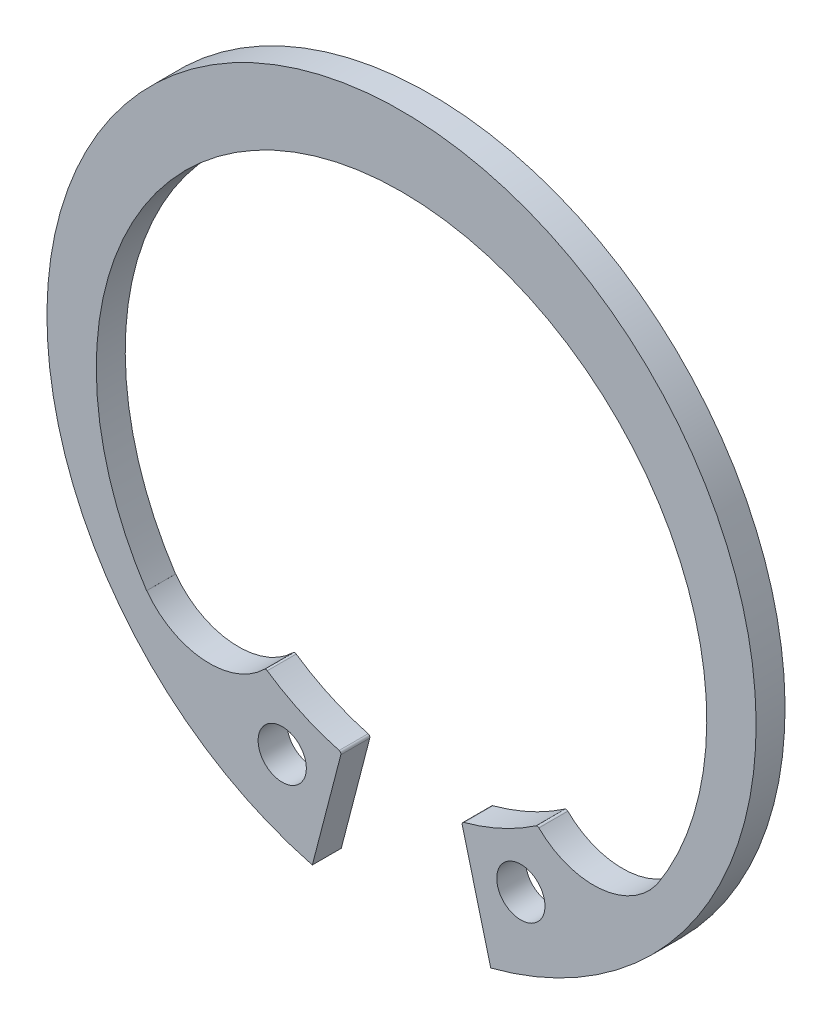
ISO-10303-21;
HEADER;
FILE_DESCRIPTION(('STEP AP214'),'2;1');
FILE_NAME('part.step','',(''),(''),'','','');
FILE_SCHEMA(('AUTOMOTIVE_DESIGN { 1 0 10303 214 1 1 1 1 }'));
ENDSEC;
DATA;
#1=APPLICATION_CONTEXT('core data for automotive mechanical design processes');
#2=APPLICATION_PROTOCOL_DEFINITION('international standard','automotive_design',2000,#1);
#3=PRODUCT_CONTEXT('',#1,'mechanical');
#4=PRODUCT('Part','Part','',(#3));
#5=PRODUCT_RELATED_PRODUCT_CATEGORY('part','',(#4));
#6=PRODUCT_DEFINITION_FORMATION('','',#4);
#7=PRODUCT_DEFINITION_CONTEXT('part definition',#1,'design');
#8=PRODUCT_DEFINITION('design','',#6,#7);
#9=PRODUCT_DEFINITION_SHAPE('','',#8);
#10=(LENGTH_UNIT() NAMED_UNIT(*) SI_UNIT(.MILLI.,.METRE.));
#11=(NAMED_UNIT(*) PLANE_ANGLE_UNIT() SI_UNIT($,.RADIAN.));
#12=(NAMED_UNIT(*) SI_UNIT($,.STERADIAN.) SOLID_ANGLE_UNIT());
#13=UNCERTAINTY_MEASURE_WITH_UNIT(LENGTH_MEASURE(1.E-05),#10,'distance_accuracy_value','');
#14=(GEOMETRIC_REPRESENTATION_CONTEXT(3) GLOBAL_UNCERTAINTY_ASSIGNED_CONTEXT((#13)) GLOBAL_UNIT_ASSIGNED_CONTEXT((#10,
#11,#12)) REPRESENTATION_CONTEXT('',''));
#15=CARTESIAN_POINT('',(0.,0.,0.));
#16=DIRECTION('',(0.,0.,1.));
#17=DIRECTION('',(1.,0.,0.));
#18=AXIS2_PLACEMENT_3D('',#15,#16,#17);
#19=CARTESIAN_POINT('',(0.,0.,-1.2));
#20=DIRECTION('',(0.,0.,1.));
#21=DIRECTION('',(1.,0.,0.));
#22=AXIS2_PLACEMENT_3D('',#19,#20,#21);
#23=CYLINDRICAL_SURFACE('',#22,14.7);
#24=CARTESIAN_POINT('',(0.,0.,-1.2));
#25=DIRECTION('',(0.,0.,1.));
#26=DIRECTION('',(1.,0.,0.));
#27=AXIS2_PLACEMENT_3D('',#24,#25,#26);
#28=CIRCLE('',#27,14.7);
#29=CARTESIAN_POINT('',(3.69832542704428,-14.2271708022248,-1.2));
#30=VERTEX_POINT('',#29);
#31=CARTESIAN_POINT('',(-3.69832542704428,-14.2271708022248,-1.2));
#32=VERTEX_POINT('',#31);
#33=EDGE_CURVE('E146',#30,#32,#28,.T.);
#34=ORIENTED_EDGE('',*,*,#33,.T.);
#35=DIRECTION('',(0.,0.,1.));
#36=VECTOR('',#35,1.);
#37=CARTESIAN_POINT('',(-3.69832542704428,-14.2271708022248,-1.2));
#38=LINE('',#37,#36);
#39=CARTESIAN_POINT('',(-3.69832542704428,-14.2271708022248,0.));
#40=VERTEX_POINT('',#39);
#41=EDGE_CURVE('E36',#32,#40,#38,.T.);
#42=ORIENTED_EDGE('',*,*,#41,.T.);
#43=CARTESIAN_POINT('',(0.,0.,0.));
#44=DIRECTION('',(0.,0.,1.));
#45=DIRECTION('',(1.,0.,0.));
#46=AXIS2_PLACEMENT_3D('',#43,#44,#45);
#47=CIRCLE('',#46,14.7);
#48=CARTESIAN_POINT('',(3.69832542704428,-14.2271708022248,0.));
#49=VERTEX_POINT('',#48);
#50=EDGE_CURVE('E57',#49,#40,#47,.T.);
#51=ORIENTED_EDGE('',*,*,#50,.F.);
#52=DIRECTION('',(0.,0.,1.));
#53=VECTOR('',#52,1.);
#54=CARTESIAN_POINT('',(3.69832542704428,-14.2271708022248,-1.2));
#55=LINE('',#54,#53);
#56=EDGE_CURVE('E11',#30,#49,#55,.T.);
#57=ORIENTED_EDGE('',*,*,#56,.F.);
#58=EDGE_LOOP('',(#34,#42,#51,#57));
#59=FACE_BOUND('',#58,.T.);
#60=ADVANCED_FACE('F33',(#59),#23,.T.);
#61=CARTESIAN_POINT('',(3.69832542704428,-14.2271708022248,-1.2));
#62=DIRECTION('',(-0.967834748450666,-0.251586763744509,0.));
#63=DIRECTION('',(0.251586763744509,-0.967834748450666,0.));
#64=AXIS2_PLACEMENT_3D('',#61,#62,#63);
#65=PLANE('',#64);
#66=DIRECTION('',(0.251586763744509,-0.967834748450666,0.));
#67=VECTOR('',#66,1.);
#68=CARTESIAN_POINT('',(3.69832542704428,-14.2271708022248,0.));
#69=LINE('',#68,#67);
#70=CARTESIAN_POINT('',(2.51574184091823,-9.6778635550339,0.));
#71=VERTEX_POINT('',#70);
#72=EDGE_CURVE('E249',#71,#49,#69,.T.);
#73=ORIENTED_EDGE('',*,*,#72,.F.);
#74=DIRECTION('',(0.,0.,1.));
#75=VECTOR('',#74,1.);
#76=CARTESIAN_POINT('',(2.51574184091823,-9.6778635550339,-1.2));
#77=LINE('',#76,#75);
#78=CARTESIAN_POINT('',(2.51574184091823,-9.6778635550339,-1.2));
#79=VERTEX_POINT('',#78);
#80=EDGE_CURVE('E222',#79,#71,#77,.T.);
#81=ORIENTED_EDGE('',*,*,#80,.F.);
#82=DIRECTION('',(0.251586763744509,-0.967834748450666,0.));
#83=VECTOR('',#82,1.);
#84=CARTESIAN_POINT('',(3.69832542704428,-14.2271708022248,-1.2));
#85=LINE('',#84,#83);
#86=EDGE_CURVE('E252',#79,#30,#85,.T.);
#87=ORIENTED_EDGE('',*,*,#86,.T.);
#88=ORIENTED_EDGE('',*,*,#56,.T.);
#89=EDGE_LOOP('',(#73,#81,#87,#88));
#90=FACE_BOUND('',#89,.T.);
#91=ADVANCED_FACE('F265',(#90),#65,.T.);
#92=CARTESIAN_POINT('',(0.,-0.854718275483989,-1.2));
#93=DIRECTION('',(0.,0.,1.));
#94=DIRECTION('',(1.,0.,0.));
#95=AXIS2_PLACEMENT_3D('',#92,#93,#94);
#96=CYLINDRICAL_SURFACE('',#95,12.654718275484);
#97=DIRECTION('',(0.,0.,1.));
#98=VECTOR('',#97,1.);
#99=CARTESIAN_POINT('',(-10.5686210689552,-7.81504465667515,-1.2));
#100=LINE('',#99,#98);
#101=CARTESIAN_POINT('',(-10.5686210689552,-7.81504465667515,-1.2));
#102=VERTEX_POINT('',#101);
#103=CARTESIAN_POINT('',(-10.5686210689552,-7.81504465667515,0.));
#104=VERTEX_POINT('',#103);
#105=EDGE_CURVE('E187',#102,#104,#100,.T.);
#106=ORIENTED_EDGE('',*,*,#105,.F.);
#107=CARTESIAN_POINT('',(0.,-0.854718275483989,-1.2));
#108=DIRECTION('',(0.,0.,-1.));
#109=DIRECTION('',(1.,0.,0.));
#110=AXIS2_PLACEMENT_3D('',#107,#108,#109);
#111=CIRCLE('',#110,12.654718275484);
#112=CARTESIAN_POINT('',(10.5686210689552,-7.81504465667515,-1.2));
#113=VERTEX_POINT('',#112);
#114=EDGE_CURVE('E65',#102,#113,#111,.T.);
#115=ORIENTED_EDGE('',*,*,#114,.T.);
#116=DIRECTION('',(0.,0.,1.));
#117=VECTOR('',#116,1.);
#118=CARTESIAN_POINT('',(10.5686210689552,-7.81504465667515,-1.2));
#119=LINE('',#118,#117);
#120=CARTESIAN_POINT('',(10.5686210689552,-7.81504465667515,0.));
#121=VERTEX_POINT('',#120);
#122=EDGE_CURVE('E225',#121,#113,#119,.F.);
#123=ORIENTED_EDGE('',*,*,#122,.F.);
#124=CARTESIAN_POINT('',(0.,-0.854718275483989,0.));
#125=DIRECTION('',(0.,0.,-1.));
#126=DIRECTION('',(1.,0.,0.));
#127=AXIS2_PLACEMENT_3D('',#124,#125,#126);
#128=CIRCLE('',#127,12.654718275484);
#129=EDGE_CURVE('E258',#104,#121,#128,.T.);
#130=ORIENTED_EDGE('',*,*,#129,.F.);
#131=EDGE_LOOP('',(#106,#115,#123,#130));
#132=FACE_BOUND('',#131,.T.);
#133=ADVANCED_FACE('F287',(#132),#96,.F.);
#134=CARTESIAN_POINT('',(-3.69832542704428,-14.2271708022248,-1.2));
#135=DIRECTION('',(0.967834748450666,-0.251586763744509,0.));
#136=DIRECTION('',(0.251586763744509,0.967834748450667,0.));
#137=AXIS2_PLACEMENT_3D('',#134,#135,#136);
#138=PLANE('',#137);
#139=DIRECTION('',(0.251586763744509,0.967834748450666,0.));
#140=VECTOR('',#139,1.);
#141=CARTESIAN_POINT('',(-3.69832542704428,-14.2271708022248,0.));
#142=LINE('',#141,#140);
#143=CARTESIAN_POINT('',(-2.51574184091823,-9.6778635550339,0.));
#144=VERTEX_POINT('',#143);
#145=EDGE_CURVE('E256',#40,#144,#142,.T.);
#146=ORIENTED_EDGE('',*,*,#145,.F.);
#147=ORIENTED_EDGE('',*,*,#41,.F.);
#148=DIRECTION('',(0.251586763744509,0.967834748450666,0.));
#149=VECTOR('',#148,1.);
#150=CARTESIAN_POINT('',(-3.69832542704428,-14.2271708022248,-1.2));
#151=LINE('',#150,#149);
#152=CARTESIAN_POINT('',(-2.51574184091823,-9.6778635550339,-1.2));
#153=VERTEX_POINT('',#152);
#154=EDGE_CURVE('E138',#32,#153,#151,.T.);
#155=ORIENTED_EDGE('',*,*,#154,.T.);
#156=DIRECTION('',(0.,0.,1.));
#157=VECTOR('',#156,1.);
#158=CARTESIAN_POINT('',(-2.51574184091823,-9.6778635550339,-1.2));
#159=LINE('',#158,#157);
#160=EDGE_CURVE('E142',#153,#144,#159,.T.);
#161=ORIENTED_EDGE('',*,*,#160,.T.);
#162=EDGE_LOOP('',(#146,#147,#155,#161));
#163=FACE_BOUND('',#162,.T.);
#164=ADVANCED_FACE('F141',(#163),#138,.T.);
#165=CARTESIAN_POINT('',(0.,0.,-1.2));
#166=DIRECTION('',(0.,0.,1.));
#167=DIRECTION('',(1.,0.,0.));
#168=AXIS2_PLACEMENT_3D('',#165,#166,#167);
#169=PLANE('',#168);
#170=ORIENTED_EDGE('',*,*,#114,.F.);
#171=DIRECTION('',(-0.80405047480539,-0.594561043094169,0.));
#172=VECTOR('',#171,1.);
#173=CARTESIAN_POINT('',(-11.8195419796392,-8.74004733348428,-1.2));
#174=LINE('',#173,#172);
#175=CARTESIAN_POINT('',(-10.5634463798531,-7.81121819472204,-1.2));
#176=VERTEX_POINT('',#175);
#177=EDGE_CURVE('E156',#176,#102,#174,.T.);
#178=ORIENTED_EDGE('',*,*,#177,.F.);
#179=CARTESIAN_POINT('',(-7.96009970057337,-5.88615432663227,-1.2));
#180=DIRECTION('',(0.,0.,-1.));
#181=DIRECTION('',(1.,0.,0.));
#182=AXIS2_PLACEMENT_3D('',#179,#180,#181);
#183=CIRCLE('',#182,3.23779011499222);
#184=CARTESIAN_POINT('',(-5.69310927120739,-8.19787213421702,-1.2));
#185=VERTEX_POINT('',#184);
#186=EDGE_CURVE('E173',#185,#176,#183,.T.);
#187=ORIENTED_EDGE('',*,*,#186,.F.);
#188=CARTESIAN_POINT('',(-5.62309267504605,-8.26927014722844,-1.2));
#189=DIRECTION('',(0.,0.,1.));
#190=DIRECTION('',(1.,0.,0.));
#191=AXIS2_PLACEMENT_3D('',#188,#189,#190);
#192=CIRCLE('',#191,0.0999999999999989);
#193=CARTESIAN_POINT('',(-5.56686174829559,-8.18657744575616,-1.2));
#194=VERTEX_POINT('',#193);
#195=EDGE_CURVE('E165',#194,#185,#192,.T.);
#196=ORIENTED_EDGE('',*,*,#195,.F.);
#197=CARTESIAN_POINT('',(0.,0.,-1.2));
#198=DIRECTION('',(0.,0.,-1.));
#199=DIRECTION('',(1.,0.,0.));
#200=AXIS2_PLACEMENT_3D('',#197,#198,#199);
#201=CIRCLE('',#200,9.9);
#202=CARTESIAN_POINT('',(-2.58640006260566,-9.55617782987285,-1.2));
#203=VERTEX_POINT('',#202);
#204=EDGE_CURVE('E161',#203,#194,#201,.T.);
#205=ORIENTED_EDGE('',*,*,#204,.F.);
#206=CARTESIAN_POINT('',(-2.61252531576329,-9.65270487865945,-1.2));
#207=DIRECTION('',(0.,0.,1.));
#208=DIRECTION('',(-1.,0.,0.));
#209=AXIS2_PLACEMENT_3D('',#206,#207,#208);
#210=CIRCLE('',#209,0.100000000000001);
#211=EDGE_CURVE('E152',#153,#203,#210,.T.);
#212=ORIENTED_EDGE('',*,*,#211,.F.);
#213=ORIENTED_EDGE('',*,*,#154,.F.);
#214=ORIENTED_EDGE('',*,*,#33,.F.);
#215=ORIENTED_EDGE('',*,*,#86,.F.);
#216=CARTESIAN_POINT('',(2.61252531576329,-9.65270487865945,-1.2));
#217=DIRECTION('',(0.,0.,1.));
#218=DIRECTION('',(1.,0.,0.));
#219=AXIS2_PLACEMENT_3D('',#216,#217,#218);
#220=CIRCLE('',#219,0.0999999999999994);
#221=CARTESIAN_POINT('',(2.58640006260566,-9.55617782987285,-1.2));
#222=VERTEX_POINT('',#221);
#223=EDGE_CURVE('E207',#222,#79,#220,.T.);
#224=ORIENTED_EDGE('',*,*,#223,.F.);
#225=CARTESIAN_POINT('',(0.,0.,-1.2));
#226=DIRECTION('',(0.,0.,-1.));
#227=DIRECTION('',(1.,0.,0.));
#228=AXIS2_PLACEMENT_3D('',#225,#226,#227);
#229=CIRCLE('',#228,9.9);
#230=CARTESIAN_POINT('',(5.56686174829559,-8.18657744575616,-1.2));
#231=VERTEX_POINT('',#230);
#232=EDGE_CURVE('E205',#231,#222,#229,.T.);
#233=ORIENTED_EDGE('',*,*,#232,.F.);
#234=CARTESIAN_POINT('',(5.62309267504605,-8.26927014722844,-1.2));
#235=DIRECTION('',(0.,0.,1.));
#236=DIRECTION('',(-1.,0.,0.));
#237=AXIS2_PLACEMENT_3D('',#234,#235,#236);
#238=CIRCLE('',#237,0.0999999999999989);
#239=CARTESIAN_POINT('',(5.69310927120739,-8.19787213421702,-1.2));
#240=VERTEX_POINT('',#239);
#241=EDGE_CURVE('E202',#240,#231,#238,.T.);
#242=ORIENTED_EDGE('',*,*,#241,.F.);
#243=CARTESIAN_POINT('',(7.96009970057337,-5.88615432663227,-1.2));
#244=DIRECTION('',(0.,0.,-1.));
#245=DIRECTION('',(1.,0.,0.));
#246=AXIS2_PLACEMENT_3D('',#243,#244,#245);
#247=CIRCLE('',#246,3.23779011499222);
#248=CARTESIAN_POINT('',(10.5634463798531,-7.81121819472204,-1.2));
#249=VERTEX_POINT('',#248);
#250=EDGE_CURVE('E198',#249,#240,#247,.T.);
#251=ORIENTED_EDGE('',*,*,#250,.F.);
#252=DIRECTION('',(-0.80405047480539,0.594561043094169,0.));
#253=VECTOR('',#252,1.);
#254=CARTESIAN_POINT('',(10.5634463798531,-7.81121819472204,-1.2));
#255=LINE('',#254,#253);
#256=EDGE_CURVE('E196',#113,#249,#255,.T.);
#257=ORIENTED_EDGE('',*,*,#256,.F.);
#258=EDGE_LOOP('',(#170,#178,#187,#196,#205,#212,#213,#214,#215,#224,#233,#242,#251,#257));
#259=FACE_BOUND('',#258,.T.);
#260=CARTESIAN_POINT('',(4.94595449661961,-10.8784205708994,-1.2));
#261=DIRECTION('',(0.,0.,1.));
#262=DIRECTION('',(1.,0.,0.));
#263=AXIS2_PLACEMENT_3D('',#260,#261,#262);
#264=CIRCLE('',#263,1.);
#265=CARTESIAN_POINT('',(5.94595449661961,-10.8784205708994,-1.2));
#266=VERTEX_POINT('',#265);
#267=EDGE_CURVE('E244',#266,#266,#264,.T.);
#268=ORIENTED_EDGE('',*,*,#267,.T.);
#269=EDGE_LOOP('',(#268));
#270=FACE_BOUND('',#269,.T.);
#271=CARTESIAN_POINT('',(-4.94595449661961,-10.8784205708994,-1.2));
#272=DIRECTION('',(0.,0.,1.));
#273=DIRECTION('',(1.,0.,0.));
#274=AXIS2_PLACEMENT_3D('',#271,#272,#273);
#275=CIRCLE('',#274,1.);
#276=CARTESIAN_POINT('',(-3.94595449661961,-10.8784205708994,-1.2));
#277=VERTEX_POINT('',#276);
#278=EDGE_CURVE('E238',#277,#277,#275,.T.);
#279=ORIENTED_EDGE('',*,*,#278,.T.);
#280=EDGE_LOOP('',(#279));
#281=FACE_BOUND('',#280,.T.);
#282=ADVANCED_FACE('F158',(#259,#270,#281),#169,.F.);
#283=CARTESIAN_POINT('',(0.,0.,0.));
#284=DIRECTION('',(0.,0.,1.));
#285=DIRECTION('',(1.,0.,0.));
#286=AXIS2_PLACEMENT_3D('',#283,#284,#285);
#287=PLANE('',#286);
#288=DIRECTION('',(-0.80405047480539,-0.594561043094169,0.));
#289=VECTOR('',#288,1.);
#290=CARTESIAN_POINT('',(-11.8195419796392,-8.74004733348428,0.));
#291=LINE('',#290,#289);
#292=CARTESIAN_POINT('',(-10.5634463798531,-7.81121819472204,0.));
#293=VERTEX_POINT('',#292);
#294=EDGE_CURVE('E163',#293,#104,#291,.T.);
#295=ORIENTED_EDGE('',*,*,#294,.T.);
#296=ORIENTED_EDGE('',*,*,#129,.T.);
#297=DIRECTION('',(-0.80405047480539,0.594561043094169,0.));
#298=VECTOR('',#297,1.);
#299=CARTESIAN_POINT('',(10.5634463798531,-7.81121819472204,0.));
#300=LINE('',#299,#298);
#301=CARTESIAN_POINT('',(10.5634463798531,-7.81121819472204,0.));
#302=VERTEX_POINT('',#301);
#303=EDGE_CURVE('E195',#121,#302,#300,.T.);
#304=ORIENTED_EDGE('',*,*,#303,.T.);
#305=CARTESIAN_POINT('',(7.96009970057337,-5.88615432663227,0.));
#306=DIRECTION('',(0.,0.,-1.));
#307=DIRECTION('',(1.,0.,0.));
#308=AXIS2_PLACEMENT_3D('',#305,#306,#307);
#309=CIRCLE('',#308,3.23779011499222);
#310=CARTESIAN_POINT('',(5.69310927120739,-8.19787213421702,0.));
#311=VERTEX_POINT('',#310);
#312=EDGE_CURVE('E212',#302,#311,#309,.T.);
#313=ORIENTED_EDGE('',*,*,#312,.T.);
#314=CARTESIAN_POINT('',(5.62309267504605,-8.26927014722844,0.));
#315=DIRECTION('',(0.,0.,1.));
#316=DIRECTION('',(-1.,0.,0.));
#317=AXIS2_PLACEMENT_3D('',#314,#315,#316);
#318=CIRCLE('',#317,0.0999999999999989);
#319=CARTESIAN_POINT('',(5.56686174829559,-8.18657744575616,0.));
#320=VERTEX_POINT('',#319);
#321=EDGE_CURVE('E215',#311,#320,#318,.T.);
#322=ORIENTED_EDGE('',*,*,#321,.T.);
#323=CARTESIAN_POINT('',(0.,0.,0.));
#324=DIRECTION('',(0.,0.,-1.));
#325=DIRECTION('',(1.,0.,0.));
#326=AXIS2_PLACEMENT_3D('',#323,#324,#325);
#327=CIRCLE('',#326,9.9);
#328=CARTESIAN_POINT('',(2.58640006260566,-9.55617782987285,0.));
#329=VERTEX_POINT('',#328);
#330=EDGE_CURVE('E218',#320,#329,#327,.T.);
#331=ORIENTED_EDGE('',*,*,#330,.T.);
#332=CARTESIAN_POINT('',(2.61252531576329,-9.65270487865945,0.));
#333=DIRECTION('',(0.,0.,1.));
#334=DIRECTION('',(1.,0.,0.));
#335=AXIS2_PLACEMENT_3D('',#332,#333,#334);
#336=CIRCLE('',#335,0.0999999999999994);
#337=EDGE_CURVE('E199',#329,#71,#336,.T.);
#338=ORIENTED_EDGE('',*,*,#337,.T.);
#339=ORIENTED_EDGE('',*,*,#72,.T.);
#340=ORIENTED_EDGE('',*,*,#50,.T.);
#341=ORIENTED_EDGE('',*,*,#145,.T.);
#342=CARTESIAN_POINT('',(-2.61252531576329,-9.65270487865945,0.));
#343=DIRECTION('',(0.,0.,1.));
#344=DIRECTION('',(-1.,0.,0.));
#345=AXIS2_PLACEMENT_3D('',#342,#343,#344);
#346=CIRCLE('',#345,0.100000000000001);
#347=CARTESIAN_POINT('',(-2.58640006260566,-9.55617782987285,0.));
#348=VERTEX_POINT('',#347);
#349=EDGE_CURVE('E154',#144,#348,#346,.T.);
#350=ORIENTED_EDGE('',*,*,#349,.T.);
#351=CARTESIAN_POINT('',(0.,0.,0.));
#352=DIRECTION('',(0.,0.,-1.));
#353=DIRECTION('',(1.,0.,0.));
#354=AXIS2_PLACEMENT_3D('',#351,#352,#353);
#355=CIRCLE('',#354,9.9);
#356=CARTESIAN_POINT('',(-5.56686174829559,-8.18657744575616,0.));
#357=VERTEX_POINT('',#356);
#358=EDGE_CURVE('E178',#348,#357,#355,.T.);
#359=ORIENTED_EDGE('',*,*,#358,.T.);
#360=CARTESIAN_POINT('',(-5.62309267504605,-8.26927014722844,0.));
#361=DIRECTION('',(0.,0.,1.));
#362=DIRECTION('',(1.,0.,0.));
#363=AXIS2_PLACEMENT_3D('',#360,#361,#362);
#364=CIRCLE('',#363,0.0999999999999989);
#365=CARTESIAN_POINT('',(-5.69310927120739,-8.19787213421702,0.));
#366=VERTEX_POINT('',#365);
#367=EDGE_CURVE('E180',#357,#366,#364,.T.);
#368=ORIENTED_EDGE('',*,*,#367,.T.);
#369=CARTESIAN_POINT('',(-7.96009970057337,-5.88615432663227,0.));
#370=DIRECTION('',(0.,0.,-1.));
#371=DIRECTION('',(1.,0.,0.));
#372=AXIS2_PLACEMENT_3D('',#369,#370,#371);
#373=CIRCLE('',#372,3.23779011499222);
#374=EDGE_CURVE('E168',#366,#293,#373,.T.);
#375=ORIENTED_EDGE('',*,*,#374,.T.);
#376=EDGE_LOOP('',(#295,#296,#304,#313,#322,#331,#338,#339,#340,#341,#350,#359,#368,#375));
#377=FACE_BOUND('',#376,.T.);
#378=CARTESIAN_POINT('',(4.94595449661961,-10.8784205708994,0.));
#379=DIRECTION('',(0.,0.,1.));
#380=DIRECTION('',(1.,0.,0.));
#381=AXIS2_PLACEMENT_3D('',#378,#379,#380);
#382=CIRCLE('',#381,1.);
#383=CARTESIAN_POINT('',(5.94595449661961,-10.8784205708994,0.));
#384=VERTEX_POINT('',#383);
#385=EDGE_CURVE('E241',#384,#384,#382,.T.);
#386=ORIENTED_EDGE('',*,*,#385,.F.);
#387=EDGE_LOOP('',(#386));
#388=FACE_BOUND('',#387,.T.);
#389=CARTESIAN_POINT('',(-4.94595449661961,-10.8784205708994,0.));
#390=DIRECTION('',(0.,0.,1.));
#391=DIRECTION('',(1.,0.,0.));
#392=AXIS2_PLACEMENT_3D('',#389,#390,#391);
#393=CIRCLE('',#392,1.);
#394=CARTESIAN_POINT('',(-3.94595449661961,-10.8784205708994,0.));
#395=VERTEX_POINT('',#394);
#396=EDGE_CURVE('E237',#395,#395,#393,.T.);
#397=ORIENTED_EDGE('',*,*,#396,.F.);
#398=EDGE_LOOP('',(#397));
#399=FACE_BOUND('',#398,.T.);
#400=ADVANCED_FACE('F260',(#377,#388,#399),#287,.T.);
#401=CARTESIAN_POINT('',(4.94595449661961,-10.8784205708994,-1.2));
#402=DIRECTION('',(0.,0.,1.));
#403=DIRECTION('',(1.,0.,0.));
#404=AXIS2_PLACEMENT_3D('',#401,#402,#403);
#405=CYLINDRICAL_SURFACE('',#404,1.);
#406=ORIENTED_EDGE('',*,*,#267,.F.);
#407=EDGE_LOOP('',(#406));
#408=FACE_BOUND('',#407,.T.);
#409=ORIENTED_EDGE('',*,*,#385,.T.);
#410=EDGE_LOOP('',(#409));
#411=FACE_BOUND('',#410,.T.);
#412=ADVANCED_FACE('F310',(#408,#411),#405,.F.);
#413=CARTESIAN_POINT('',(-4.94595449661961,-10.8784205708994,-1.2));
#414=DIRECTION('',(0.,0.,1.));
#415=DIRECTION('',(1.,0.,0.));
#416=AXIS2_PLACEMENT_3D('',#413,#414,#415);
#417=CYLINDRICAL_SURFACE('',#416,1.);
#418=ORIENTED_EDGE('',*,*,#278,.F.);
#419=EDGE_LOOP('',(#418));
#420=FACE_BOUND('',#419,.T.);
#421=ORIENTED_EDGE('',*,*,#396,.T.);
#422=EDGE_LOOP('',(#421));
#423=FACE_BOUND('',#422,.T.);
#424=ADVANCED_FACE('F303',(#420,#423),#417,.F.);
#425=CARTESIAN_POINT('',(0.,0.,-1.2));
#426=DIRECTION('',(0.,0.,1.));
#427=DIRECTION('',(1.,0.,0.));
#428=AXIS2_PLACEMENT_3D('',#425,#426,#427);
#429=CYLINDRICAL_SURFACE('',#428,9.9);
#430=ORIENTED_EDGE('',*,*,#330,.F.);
#431=DIRECTION('',(0.,0.,1.));
#432=VECTOR('',#431,1.);
#433=CARTESIAN_POINT('',(5.56686174829559,-8.18657744575616,-1.2));
#434=LINE('',#433,#432);
#435=EDGE_CURVE('E229',#231,#320,#434,.T.);
#436=ORIENTED_EDGE('',*,*,#435,.F.);
#437=ORIENTED_EDGE('',*,*,#232,.T.);
#438=DIRECTION('',(0.,0.,1.));
#439=VECTOR('',#438,1.);
#440=CARTESIAN_POINT('',(2.58640006260566,-9.55617782987285,-1.2));
#441=LINE('',#440,#439);
#442=EDGE_CURVE('E226',#222,#329,#441,.T.);
#443=ORIENTED_EDGE('',*,*,#442,.T.);
#444=EDGE_LOOP('',(#430,#436,#437,#443));
#445=FACE_BOUND('',#444,.T.);
#446=ADVANCED_FACE('F301',(#445),#429,.F.);
#447=CARTESIAN_POINT('',(2.61252531576329,-9.65270487865945,-1.2));
#448=DIRECTION('',(0.,0.,1.));
#449=DIRECTION('',(1.,0.,0.));
#450=AXIS2_PLACEMENT_3D('',#447,#448,#449);
#451=CYLINDRICAL_SURFACE('',#450,0.0999999999999994);
#452=ORIENTED_EDGE('',*,*,#337,.F.);
#453=ORIENTED_EDGE('',*,*,#442,.F.);
#454=ORIENTED_EDGE('',*,*,#223,.T.);
#455=ORIENTED_EDGE('',*,*,#80,.T.);
#456=EDGE_LOOP('',(#452,#453,#454,#455));
#457=FACE_BOUND('',#456,.T.);
#458=ADVANCED_FACE('F267',(#457),#451,.T.);
#459=CARTESIAN_POINT('',(5.62309267504605,-8.26927014722844,-1.2));
#460=DIRECTION('',(0.,0.,1.));
#461=DIRECTION('',(1.,0.,0.));
#462=AXIS2_PLACEMENT_3D('',#459,#460,#461);
#463=CYLINDRICAL_SURFACE('',#462,0.0999999999999989);
#464=ORIENTED_EDGE('',*,*,#321,.F.);
#465=DIRECTION('',(0.,0.,1.));
#466=VECTOR('',#465,1.);
#467=CARTESIAN_POINT('',(5.69310927120739,-8.19787213421702,-1.2));
#468=LINE('',#467,#466);
#469=EDGE_CURVE('E232',#240,#311,#468,.T.);
#470=ORIENTED_EDGE('',*,*,#469,.F.);
#471=ORIENTED_EDGE('',*,*,#241,.T.);
#472=ORIENTED_EDGE('',*,*,#435,.T.);
#473=EDGE_LOOP('',(#464,#470,#471,#472));
#474=FACE_BOUND('',#473,.T.);
#475=ADVANCED_FACE('F299',(#474),#463,.T.);
#476=CARTESIAN_POINT('',(7.96009970057337,-5.88615432663227,-1.2));
#477=DIRECTION('',(0.,0.,1.));
#478=DIRECTION('',(1.,0.,0.));
#479=AXIS2_PLACEMENT_3D('',#476,#477,#478);
#480=CYLINDRICAL_SURFACE('',#479,3.23779011499222);
#481=ORIENTED_EDGE('',*,*,#312,.F.);
#482=DIRECTION('',(0.,0.,1.));
#483=VECTOR('',#482,1.);
#484=CARTESIAN_POINT('',(10.5634463798531,-7.81121819472204,-1.2));
#485=LINE('',#484,#483);
#486=EDGE_CURVE('E210',#249,#302,#485,.T.);
#487=ORIENTED_EDGE('',*,*,#486,.F.);
#488=ORIENTED_EDGE('',*,*,#250,.T.);
#489=ORIENTED_EDGE('',*,*,#469,.T.);
#490=EDGE_LOOP('',(#481,#487,#488,#489));
#491=FACE_BOUND('',#490,.T.);
#492=ADVANCED_FACE('F296',(#491),#480,.F.);
#493=CARTESIAN_POINT('',(10.5634463798531,-7.81121819472204,-1.2));
#494=DIRECTION('',(0.59456104309417,0.80405047480539,0.));
#495=DIRECTION('',(-0.80405047480539,0.59456104309417,0.));
#496=AXIS2_PLACEMENT_3D('',#493,#494,#495);
#497=PLANE('',#496);
#498=ORIENTED_EDGE('',*,*,#303,.F.);
#499=ORIENTED_EDGE('',*,*,#122,.T.);
#500=ORIENTED_EDGE('',*,*,#256,.T.);
#501=ORIENTED_EDGE('',*,*,#486,.T.);
#502=EDGE_LOOP('',(#498,#499,#500,#501));
#503=FACE_BOUND('',#502,.T.);
#504=ADVANCED_FACE('F293',(#503),#497,.T.);
#505=CARTESIAN_POINT('',(0.,0.,-1.2));
#506=DIRECTION('',(0.,0.,1.));
#507=DIRECTION('',(1.,0.,0.));
#508=AXIS2_PLACEMENT_3D('',#505,#506,#507);
#509=CYLINDRICAL_SURFACE('',#508,9.9);
#510=ORIENTED_EDGE('',*,*,#358,.F.);
#511=DIRECTION('',(0.,0.,1.));
#512=VECTOR('',#511,1.);
#513=CARTESIAN_POINT('',(-2.58640006260566,-9.55617782987285,-1.2));
#514=LINE('',#513,#512);
#515=EDGE_CURVE('E155',#203,#348,#514,.T.);
#516=ORIENTED_EDGE('',*,*,#515,.F.);
#517=ORIENTED_EDGE('',*,*,#204,.T.);
#518=DIRECTION('',(0.,0.,1.));
#519=VECTOR('',#518,1.);
#520=CARTESIAN_POINT('',(-5.56686174829559,-8.18657744575616,-1.2));
#521=LINE('',#520,#519);
#522=EDGE_CURVE('E190',#194,#357,#521,.T.);
#523=ORIENTED_EDGE('',*,*,#522,.T.);
#524=EDGE_LOOP('',(#510,#516,#517,#523));
#525=FACE_BOUND('',#524,.T.);
#526=ADVANCED_FACE('F275',(#525),#509,.F.);
#527=CARTESIAN_POINT('',(-11.8195419796392,-8.74004733348428,-1.2));
#528=DIRECTION('',(-0.59456104309417,0.80405047480539,0.));
#529=DIRECTION('',(-0.80405047480539,-0.59456104309417,0.));
#530=AXIS2_PLACEMENT_3D('',#527,#528,#529);
#531=PLANE('',#530);
#532=ORIENTED_EDGE('',*,*,#177,.T.);
#533=ORIENTED_EDGE('',*,*,#105,.T.);
#534=ORIENTED_EDGE('',*,*,#294,.F.);
#535=DIRECTION('',(0.,0.,1.));
#536=VECTOR('',#535,1.);
#537=CARTESIAN_POINT('',(-10.5634463798531,-7.81121819472204,-1.2));
#538=LINE('',#537,#536);
#539=EDGE_CURVE('E185',#176,#293,#538,.T.);
#540=ORIENTED_EDGE('',*,*,#539,.F.);
#541=EDGE_LOOP('',(#532,#533,#534,#540));
#542=FACE_BOUND('',#541,.T.);
#543=ADVANCED_FACE('F285',(#542),#531,.T.);
#544=CARTESIAN_POINT('',(-7.96009970057337,-5.88615432663227,-1.2));
#545=DIRECTION('',(0.,0.,1.));
#546=DIRECTION('',(1.,0.,0.));
#547=AXIS2_PLACEMENT_3D('',#544,#545,#546);
#548=CYLINDRICAL_SURFACE('',#547,3.23779011499222);
#549=ORIENTED_EDGE('',*,*,#374,.F.);
#550=DIRECTION('',(0.,0.,1.));
#551=VECTOR('',#550,1.);
#552=CARTESIAN_POINT('',(-5.69310927120739,-8.19787213421702,-1.2));
#553=LINE('',#552,#551);
#554=EDGE_CURVE('E188',#185,#366,#553,.T.);
#555=ORIENTED_EDGE('',*,*,#554,.F.);
#556=ORIENTED_EDGE('',*,*,#186,.T.);
#557=ORIENTED_EDGE('',*,*,#539,.T.);
#558=EDGE_LOOP('',(#549,#555,#556,#557));
#559=FACE_BOUND('',#558,.T.);
#560=ADVANCED_FACE('F281',(#559),#548,.F.);
#561=CARTESIAN_POINT('',(-5.62309267504605,-8.26927014722844,-1.2));
#562=DIRECTION('',(0.,0.,1.));
#563=DIRECTION('',(1.,0.,0.));
#564=AXIS2_PLACEMENT_3D('',#561,#562,#563);
#565=CYLINDRICAL_SURFACE('',#564,0.0999999999999989);
#566=ORIENTED_EDGE('',*,*,#367,.F.);
#567=ORIENTED_EDGE('',*,*,#522,.F.);
#568=ORIENTED_EDGE('',*,*,#195,.T.);
#569=ORIENTED_EDGE('',*,*,#554,.T.);
#570=EDGE_LOOP('',(#566,#567,#568,#569));
#571=FACE_BOUND('',#570,.T.);
#572=ADVANCED_FACE('F277',(#571),#565,.T.);
#573=CARTESIAN_POINT('',(-2.61252531576329,-9.65270487865945,-1.2));
#574=DIRECTION('',(0.,0.,1.));
#575=DIRECTION('',(1.,0.,0.));
#576=AXIS2_PLACEMENT_3D('',#573,#574,#575);
#577=CYLINDRICAL_SURFACE('',#576,0.100000000000001);
#578=ORIENTED_EDGE('',*,*,#349,.F.);
#579=ORIENTED_EDGE('',*,*,#160,.F.);
#580=ORIENTED_EDGE('',*,*,#211,.T.);
#581=ORIENTED_EDGE('',*,*,#515,.T.);
#582=EDGE_LOOP('',(#578,#579,#580,#581));
#583=FACE_BOUND('',#582,.T.);
#584=ADVANCED_FACE('F150',(#583),#577,.T.);
#585=CLOSED_SHELL('',(#60,#91,#133,#164,#282,#400,#412,#424,#446,#458,#475,#492,#504,#526,#543,
#560,#572,#584));
#586=MANIFOLD_SOLID_BREP('B2',#585);
#587=ADVANCED_BREP_SHAPE_REPRESENTATION('',(#18,#586),#14);
#588=SHAPE_DEFINITION_REPRESENTATION(#9,#587);
ENDSEC;
END-ISO-10303-21;
